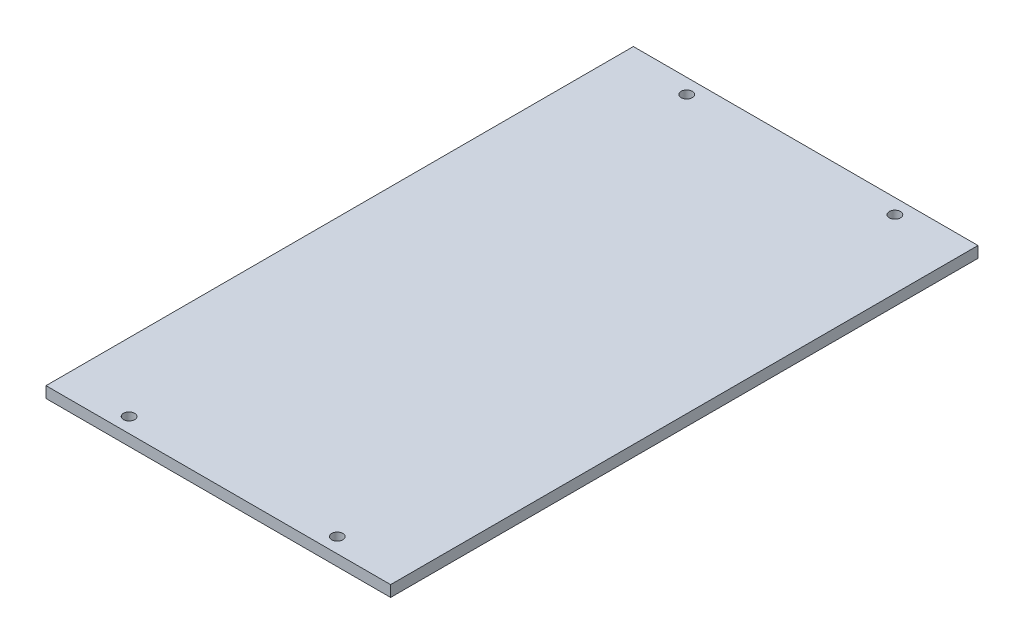
ISO-10303-21;
HEADER;
FILE_DESCRIPTION(('STEP AP214'),'2;1');
FILE_NAME('part.step','',(''),(''),'','','');
FILE_SCHEMA(('AUTOMOTIVE_DESIGN { 1 0 10303 214 1 1 1 1 }'));
ENDSEC;
DATA;
#1=APPLICATION_CONTEXT('core data for automotive mechanical design processes');
#2=APPLICATION_PROTOCOL_DEFINITION('international standard','automotive_design',2000,#1);
#3=PRODUCT_CONTEXT('',#1,'mechanical');
#4=PRODUCT('Part','Part','',(#3));
#5=PRODUCT_RELATED_PRODUCT_CATEGORY('part','',(#4));
#6=PRODUCT_DEFINITION_FORMATION('','',#4);
#7=PRODUCT_DEFINITION_CONTEXT('part definition',#1,'design');
#8=PRODUCT_DEFINITION('design','',#6,#7);
#9=PRODUCT_DEFINITION_SHAPE('','',#8);
#10=(LENGTH_UNIT() NAMED_UNIT(*) SI_UNIT(.MILLI.,.METRE.));
#11=(NAMED_UNIT(*) PLANE_ANGLE_UNIT() SI_UNIT($,.RADIAN.));
#12=(NAMED_UNIT(*) SI_UNIT($,.STERADIAN.) SOLID_ANGLE_UNIT());
#13=UNCERTAINTY_MEASURE_WITH_UNIT(LENGTH_MEASURE(1.E-05),#10,'distance_accuracy_value','');
#14=(GEOMETRIC_REPRESENTATION_CONTEXT(3) GLOBAL_UNCERTAINTY_ASSIGNED_CONTEXT((#13)) GLOBAL_UNIT_ASSIGNED_CONTEXT((#10,
#11,#12)) REPRESENTATION_CONTEXT('',''));
#15=CARTESIAN_POINT('',(0.,0.,0.));
#16=DIRECTION('',(0.,0.,1.));
#17=DIRECTION('',(1.,0.,0.));
#18=AXIS2_PLACEMENT_3D('',#15,#16,#17);
#19=CARTESIAN_POINT('',(46.35,0.,-79.));
#20=DIRECTION('',(0.,0.,-1.));
#21=DIRECTION('',(-1.,0.,0.));
#22=AXIS2_PLACEMENT_3D('',#19,#20,#21);
#23=PLANE('',#22);
#24=DIRECTION('',(-1.,0.,0.));
#25=VECTOR('',#24,1.);
#26=CARTESIAN_POINT('',(46.35,3.,-79.));
#27=LINE('',#26,#25);
#28=CARTESIAN_POINT('',(46.35,3.,-79.));
#29=VERTEX_POINT('',#28);
#30=CARTESIAN_POINT('',(-46.35,3.,-79.));
#31=VERTEX_POINT('',#30);
#32=EDGE_CURVE('E98',#29,#31,#27,.T.);
#33=ORIENTED_EDGE('',*,*,#32,.F.);
#34=DIRECTION('',(0.,1.,0.));
#35=VECTOR('',#34,1.);
#36=CARTESIAN_POINT('',(46.35,0.,-79.));
#37=LINE('',#36,#35);
#38=CARTESIAN_POINT('',(46.35,0.,-79.));
#39=VERTEX_POINT('',#38);
#40=EDGE_CURVE('E11',#39,#29,#37,.T.);
#41=ORIENTED_EDGE('',*,*,#40,.F.);
#42=DIRECTION('',(-1.,0.,0.));
#43=VECTOR('',#42,1.);
#44=CARTESIAN_POINT('',(46.35,0.,-79.));
#45=LINE('',#44,#43);
#46=CARTESIAN_POINT('',(-46.35,0.,-79.));
#47=VERTEX_POINT('',#46);
#48=EDGE_CURVE('E91',#39,#47,#45,.T.);
#49=ORIENTED_EDGE('',*,*,#48,.T.);
#50=DIRECTION('',(0.,1.,0.));
#51=VECTOR('',#50,1.);
#52=CARTESIAN_POINT('',(-46.35,0.,-79.));
#53=LINE('',#52,#51);
#54=EDGE_CURVE('E36',#47,#31,#53,.T.);
#55=ORIENTED_EDGE('',*,*,#54,.T.);
#56=EDGE_LOOP('',(#33,#41,#49,#55));
#57=FACE_BOUND('',#56,.T.);
#58=ADVANCED_FACE('F33',(#57),#23,.T.);
#59=CARTESIAN_POINT('',(46.35,0.,79.));
#60=DIRECTION('',(1.,0.,0.));
#61=DIRECTION('',(0.,0.,-1.));
#62=AXIS2_PLACEMENT_3D('',#59,#60,#61);
#63=PLANE('',#62);
#64=DIRECTION('',(0.,0.,-1.));
#65=VECTOR('',#64,1.);
#66=CARTESIAN_POINT('',(46.35,3.,79.));
#67=LINE('',#66,#65);
#68=CARTESIAN_POINT('',(46.35,3.,79.));
#69=VERTEX_POINT('',#68);
#70=EDGE_CURVE('E93',#69,#29,#67,.T.);
#71=ORIENTED_EDGE('',*,*,#70,.F.);
#72=DIRECTION('',(0.,1.,0.));
#73=VECTOR('',#72,1.);
#74=CARTESIAN_POINT('',(46.35,0.,79.));
#75=LINE('',#74,#73);
#76=CARTESIAN_POINT('',(46.35,0.,79.));
#77=VERTEX_POINT('',#76);
#78=EDGE_CURVE('E42',#77,#69,#75,.T.);
#79=ORIENTED_EDGE('',*,*,#78,.F.);
#80=DIRECTION('',(0.,0.,-1.));
#81=VECTOR('',#80,1.);
#82=CARTESIAN_POINT('',(46.35,0.,79.));
#83=LINE('',#82,#81);
#84=EDGE_CURVE('E88',#77,#39,#83,.T.);
#85=ORIENTED_EDGE('',*,*,#84,.T.);
#86=ORIENTED_EDGE('',*,*,#40,.T.);
#87=EDGE_LOOP('',(#71,#79,#85,#86));
#88=FACE_BOUND('',#87,.T.);
#89=ADVANCED_FACE('F109',(#88),#63,.T.);
#90=CARTESIAN_POINT('',(-46.35,0.,79.));
#91=DIRECTION('',(0.,0.,1.));
#92=DIRECTION('',(1.,0.,0.));
#93=AXIS2_PLACEMENT_3D('',#90,#91,#92);
#94=PLANE('',#93);
#95=DIRECTION('',(1.,0.,0.));
#96=VECTOR('',#95,1.);
#97=CARTESIAN_POINT('',(-46.35,3.,79.));
#98=LINE('',#97,#96);
#99=CARTESIAN_POINT('',(-46.35,3.,79.));
#100=VERTEX_POINT('',#99);
#101=EDGE_CURVE('E83',#100,#69,#98,.T.);
#102=ORIENTED_EDGE('',*,*,#101,.F.);
#103=DIRECTION('',(0.,1.,0.));
#104=VECTOR('',#103,1.);
#105=CARTESIAN_POINT('',(-46.35,0.,79.));
#106=LINE('',#105,#104);
#107=CARTESIAN_POINT('',(-46.35,0.,79.));
#108=VERTEX_POINT('',#107);
#109=EDGE_CURVE('E78',#108,#100,#106,.T.);
#110=ORIENTED_EDGE('',*,*,#109,.F.);
#111=DIRECTION('',(1.,0.,0.));
#112=VECTOR('',#111,1.);
#113=CARTESIAN_POINT('',(-46.35,0.,79.));
#114=LINE('',#113,#112);
#115=EDGE_CURVE('E81',#108,#77,#114,.T.);
#116=ORIENTED_EDGE('',*,*,#115,.T.);
#117=ORIENTED_EDGE('',*,*,#78,.T.);
#118=EDGE_LOOP('',(#102,#110,#116,#117));
#119=FACE_BOUND('',#118,.T.);
#120=ADVANCED_FACE('F80',(#119),#94,.T.);
#121=CARTESIAN_POINT('',(-46.35,0.,-79.));
#122=DIRECTION('',(-1.,0.,0.));
#123=DIRECTION('',(0.,0.,1.));
#124=AXIS2_PLACEMENT_3D('',#121,#122,#123);
#125=PLANE('',#124);
#126=DIRECTION('',(0.,0.,1.));
#127=VECTOR('',#126,1.);
#128=CARTESIAN_POINT('',(-46.35,3.,-79.));
#129=LINE('',#128,#127);
#130=EDGE_CURVE('E101',#31,#100,#129,.T.);
#131=ORIENTED_EDGE('',*,*,#130,.F.);
#132=ORIENTED_EDGE('',*,*,#54,.F.);
#133=DIRECTION('',(0.,0.,1.));
#134=VECTOR('',#133,1.);
#135=CARTESIAN_POINT('',(-46.35,0.,-79.));
#136=LINE('',#135,#134);
#137=EDGE_CURVE('E87',#47,#108,#136,.T.);
#138=ORIENTED_EDGE('',*,*,#137,.T.);
#139=ORIENTED_EDGE('',*,*,#109,.T.);
#140=EDGE_LOOP('',(#131,#132,#138,#139));
#141=FACE_BOUND('',#140,.T.);
#142=ADVANCED_FACE('F90',(#141),#125,.T.);
#143=CARTESIAN_POINT('',(0.,0.,0.));
#144=DIRECTION('',(0.,1.,0.));
#145=DIRECTION('',(0.,0.,1.));
#146=AXIS2_PLACEMENT_3D('',#143,#144,#145);
#147=PLANE('',#146);
#148=CARTESIAN_POINT('',(-28.,0.,75.));
#149=DIRECTION('',(0.,1.,0.));
#150=DIRECTION('',(0.,0.,-1.));
#151=AXIS2_PLACEMENT_3D('',#148,#149,#150);
#152=CIRCLE('',#151,1.5);
#153=CARTESIAN_POINT('',(-28.,0.,73.5));
#154=VERTEX_POINT('',#153);
#155=EDGE_CURVE('E150',#154,#154,#152,.T.);
#156=ORIENTED_EDGE('',*,*,#155,.T.);
#157=EDGE_LOOP('',(#156));
#158=FACE_BOUND('',#157,.T.);
#159=CARTESIAN_POINT('',(-28.,0.,-75.));
#160=DIRECTION('',(0.,1.,0.));
#161=DIRECTION('',(0.,0.,-1.));
#162=AXIS2_PLACEMENT_3D('',#159,#160,#161);
#163=CIRCLE('',#162,1.5);
#164=CARTESIAN_POINT('',(-28.,0.,-76.5));
#165=VERTEX_POINT('',#164);
#166=EDGE_CURVE('E158',#165,#165,#163,.T.);
#167=ORIENTED_EDGE('',*,*,#166,.T.);
#168=EDGE_LOOP('',(#167));
#169=FACE_BOUND('',#168,.T.);
#170=CARTESIAN_POINT('',(28.,0.,-75.));
#171=DIRECTION('',(0.,1.,0.));
#172=DIRECTION('',(0.,0.,-1.));
#173=AXIS2_PLACEMENT_3D('',#170,#171,#172);
#174=CIRCLE('',#173,1.5);
#175=CARTESIAN_POINT('',(28.,0.,-76.5));
#176=VERTEX_POINT('',#175);
#177=EDGE_CURVE('E164',#176,#176,#174,.T.);
#178=ORIENTED_EDGE('',*,*,#177,.T.);
#179=EDGE_LOOP('',(#178));
#180=FACE_BOUND('',#179,.T.);
#181=CARTESIAN_POINT('',(28.,0.,75.));
#182=DIRECTION('',(0.,1.,0.));
#183=DIRECTION('',(0.,0.,-1.));
#184=AXIS2_PLACEMENT_3D('',#181,#182,#183);
#185=CIRCLE('',#184,1.5);
#186=CARTESIAN_POINT('',(28.,0.,73.5));
#187=VERTEX_POINT('',#186);
#188=EDGE_CURVE('E102',#187,#187,#185,.T.);
#189=ORIENTED_EDGE('',*,*,#188,.T.);
#190=EDGE_LOOP('',(#189));
#191=FACE_BOUND('',#190,.T.);
#192=ORIENTED_EDGE('',*,*,#48,.F.);
#193=ORIENTED_EDGE('',*,*,#84,.F.);
#194=ORIENTED_EDGE('',*,*,#115,.F.);
#195=ORIENTED_EDGE('',*,*,#137,.F.);
#196=EDGE_LOOP('',(#192,#193,#194,#195));
#197=FACE_BOUND('',#196,.T.);
#198=ADVANCED_FACE('F86',(#158,#169,#180,#191,#197),#147,.F.);
#199=CARTESIAN_POINT('',(0.,3.,0.));
#200=DIRECTION('',(0.,1.,0.));
#201=DIRECTION('',(0.,0.,1.));
#202=AXIS2_PLACEMENT_3D('',#199,#200,#201);
#203=PLANE('',#202);
#204=CARTESIAN_POINT('',(-28.,3.,75.));
#205=DIRECTION('',(0.,1.,0.));
#206=DIRECTION('',(0.,0.,-1.));
#207=AXIS2_PLACEMENT_3D('',#204,#205,#206);
#208=CIRCLE('',#207,1.5);
#209=CARTESIAN_POINT('',(-28.,3.,73.5));
#210=VERTEX_POINT('',#209);
#211=EDGE_CURVE('E153',#210,#210,#208,.T.);
#212=ORIENTED_EDGE('',*,*,#211,.F.);
#213=EDGE_LOOP('',(#212));
#214=FACE_BOUND('',#213,.T.);
#215=CARTESIAN_POINT('',(-28.,3.,-75.));
#216=DIRECTION('',(0.,1.,0.));
#217=DIRECTION('',(0.,0.,-1.));
#218=AXIS2_PLACEMENT_3D('',#215,#216,#217);
#219=CIRCLE('',#218,1.5);
#220=CARTESIAN_POINT('',(-28.,3.,-76.5));
#221=VERTEX_POINT('',#220);
#222=EDGE_CURVE('E155',#221,#221,#219,.T.);
#223=ORIENTED_EDGE('',*,*,#222,.F.);
#224=EDGE_LOOP('',(#223));
#225=FACE_BOUND('',#224,.T.);
#226=CARTESIAN_POINT('',(28.,3.,-75.));
#227=DIRECTION('',(0.,1.,0.));
#228=DIRECTION('',(0.,0.,-1.));
#229=AXIS2_PLACEMENT_3D('',#226,#227,#228);
#230=CIRCLE('',#229,1.5);
#231=CARTESIAN_POINT('',(28.,3.,-76.5));
#232=VERTEX_POINT('',#231);
#233=EDGE_CURVE('E161',#232,#232,#230,.T.);
#234=ORIENTED_EDGE('',*,*,#233,.F.);
#235=EDGE_LOOP('',(#234));
#236=FACE_BOUND('',#235,.T.);
#237=CARTESIAN_POINT('',(28.,3.,75.));
#238=DIRECTION('',(0.,1.,0.));
#239=DIRECTION('',(0.,0.,-1.));
#240=AXIS2_PLACEMENT_3D('',#237,#238,#239);
#241=CIRCLE('',#240,1.5);
#242=CARTESIAN_POINT('',(28.,3.,73.5));
#243=VERTEX_POINT('',#242);
#244=EDGE_CURVE('E167',#243,#243,#241,.T.);
#245=ORIENTED_EDGE('',*,*,#244,.F.);
#246=EDGE_LOOP('',(#245));
#247=FACE_BOUND('',#246,.T.);
#248=ORIENTED_EDGE('',*,*,#32,.T.);
#249=ORIENTED_EDGE('',*,*,#130,.T.);
#250=ORIENTED_EDGE('',*,*,#101,.T.);
#251=ORIENTED_EDGE('',*,*,#70,.T.);
#252=EDGE_LOOP('',(#248,#249,#250,#251));
#253=FACE_BOUND('',#252,.T.);
#254=ADVANCED_FACE('F108',(#214,#225,#236,#247,#253),#203,.T.);
#255=CARTESIAN_POINT('',(28.,0.,75.));
#256=DIRECTION('',(0.,1.,0.));
#257=DIRECTION('',(0.,0.,1.));
#258=AXIS2_PLACEMENT_3D('',#255,#256,#257);
#259=CYLINDRICAL_SURFACE('',#258,1.5);
#260=ORIENTED_EDGE('',*,*,#188,.F.);
#261=EDGE_LOOP('',(#260));
#262=FACE_BOUND('',#261,.T.);
#263=ORIENTED_EDGE('',*,*,#244,.T.);
#264=EDGE_LOOP('',(#263));
#265=FACE_BOUND('',#264,.T.);
#266=ADVANCED_FACE('F127',(#262,#265),#259,.F.);
#267=CARTESIAN_POINT('',(28.,0.,-75.));
#268=DIRECTION('',(0.,1.,0.));
#269=DIRECTION('',(0.,0.,1.));
#270=AXIS2_PLACEMENT_3D('',#267,#268,#269);
#271=CYLINDRICAL_SURFACE('',#270,1.5);
#272=ORIENTED_EDGE('',*,*,#177,.F.);
#273=EDGE_LOOP('',(#272));
#274=FACE_BOUND('',#273,.T.);
#275=ORIENTED_EDGE('',*,*,#233,.T.);
#276=EDGE_LOOP('',(#275));
#277=FACE_BOUND('',#276,.T.);
#278=ADVANCED_FACE('F134',(#274,#277),#271,.F.);
#279=CARTESIAN_POINT('',(-28.,0.,-75.));
#280=DIRECTION('',(0.,1.,0.));
#281=DIRECTION('',(0.,0.,1.));
#282=AXIS2_PLACEMENT_3D('',#279,#280,#281);
#283=CYLINDRICAL_SURFACE('',#282,1.5);
#284=ORIENTED_EDGE('',*,*,#166,.F.);
#285=EDGE_LOOP('',(#284));
#286=FACE_BOUND('',#285,.T.);
#287=ORIENTED_EDGE('',*,*,#222,.T.);
#288=EDGE_LOOP('',(#287));
#289=FACE_BOUND('',#288,.T.);
#290=ADVANCED_FACE('F138',(#286,#289),#283,.F.);
#291=CARTESIAN_POINT('',(-28.,0.,75.));
#292=DIRECTION('',(0.,1.,0.));
#293=DIRECTION('',(0.,0.,1.));
#294=AXIS2_PLACEMENT_3D('',#291,#292,#293);
#295=CYLINDRICAL_SURFACE('',#294,1.5);
#296=ORIENTED_EDGE('',*,*,#155,.F.);
#297=EDGE_LOOP('',(#296));
#298=FACE_BOUND('',#297,.T.);
#299=ORIENTED_EDGE('',*,*,#211,.T.);
#300=EDGE_LOOP('',(#299));
#301=FACE_BOUND('',#300,.T.);
#302=ADVANCED_FACE('F142',(#298,#301),#295,.F.);
#303=CLOSED_SHELL('',(#58,#89,#120,#142,#198,#254,#266,#278,#290,#302));
#304=MANIFOLD_SOLID_BREP('B2',#303);
#305=ADVANCED_BREP_SHAPE_REPRESENTATION('',(#18,#304),#14);
#306=SHAPE_DEFINITION_REPRESENTATION(#9,#305);
ENDSEC;
END-ISO-10303-21;
